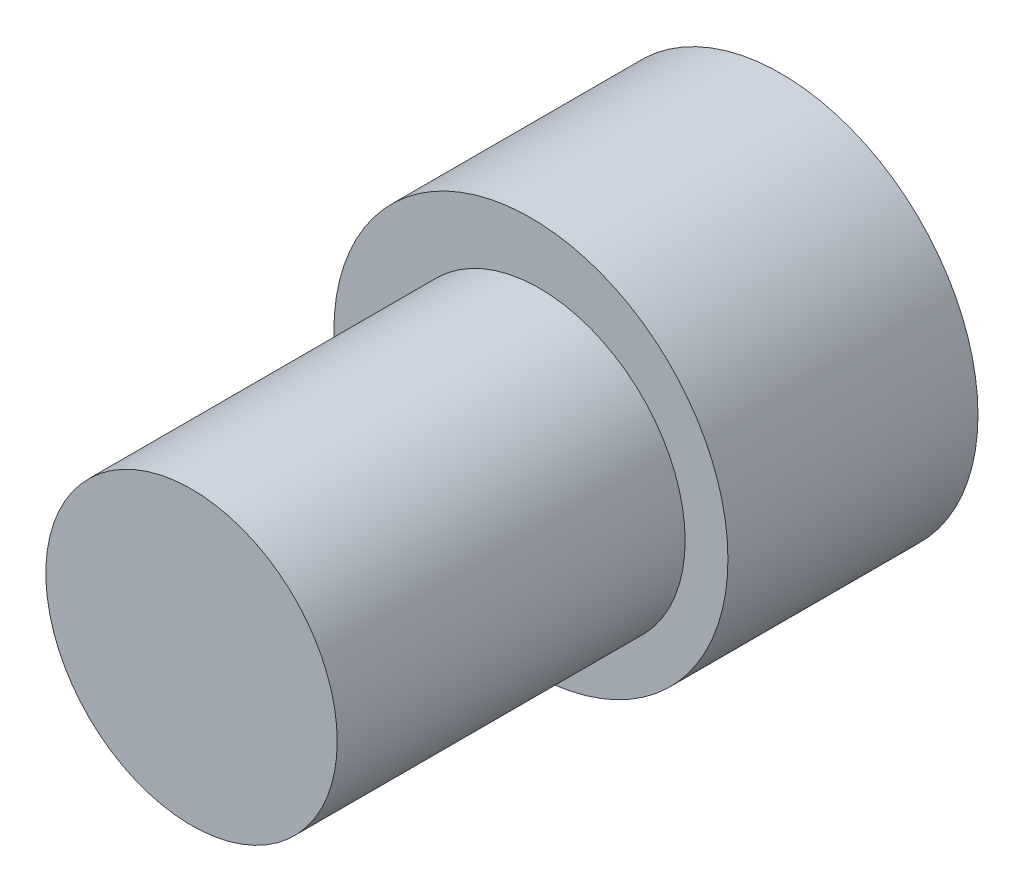
ISO-10303-21;
HEADER;
FILE_DESCRIPTION(('STEP AP214'),'2;1');
FILE_NAME('part.step','',(''),(''),'','','');
FILE_SCHEMA(('AUTOMOTIVE_DESIGN { 1 0 10303 214 1 1 1 1 }'));
ENDSEC;
DATA;
#1=APPLICATION_CONTEXT('core data for automotive mechanical design processes');
#2=APPLICATION_PROTOCOL_DEFINITION('international standard','automotive_design',2000,#1);
#3=PRODUCT_CONTEXT('',#1,'mechanical');
#4=PRODUCT('Part','Part','',(#3));
#5=PRODUCT_RELATED_PRODUCT_CATEGORY('part','',(#4));
#6=PRODUCT_DEFINITION_FORMATION('','',#4);
#7=PRODUCT_DEFINITION_CONTEXT('part definition',#1,'design');
#8=PRODUCT_DEFINITION('design','',#6,#7);
#9=PRODUCT_DEFINITION_SHAPE('','',#8);
#10=(LENGTH_UNIT() NAMED_UNIT(*) SI_UNIT(.MILLI.,.METRE.));
#11=(NAMED_UNIT(*) PLANE_ANGLE_UNIT() SI_UNIT($,.RADIAN.));
#12=(NAMED_UNIT(*) SI_UNIT($,.STERADIAN.) SOLID_ANGLE_UNIT());
#13=UNCERTAINTY_MEASURE_WITH_UNIT(LENGTH_MEASURE(1.E-05),#10,'distance_accuracy_value','');
#14=(GEOMETRIC_REPRESENTATION_CONTEXT(3) GLOBAL_UNCERTAINTY_ASSIGNED_CONTEXT((#13)) GLOBAL_UNIT_ASSIGNED_CONTEXT((#10,
#11,#12)) REPRESENTATION_CONTEXT('',''));
#15=CARTESIAN_POINT('',(0.,0.,0.));
#16=DIRECTION('',(0.,0.,1.));
#17=DIRECTION('',(1.,0.,0.));
#18=AXIS2_PLACEMENT_3D('',#15,#16,#17);
#19=CARTESIAN_POINT('',(-23.4305547451006,35.5720874073634,-27.2413561072351));
#20=DIRECTION('',(0.,0.,1.));
#21=DIRECTION('',(1.,0.,0.));
#22=AXIS2_PLACEMENT_3D('',#19,#20,#21);
#23=CYLINDRICAL_SURFACE('',#22,3.35000000000001);
#24=CARTESIAN_POINT('',(-23.4305547451006,35.5720874073634,-27.2413561072351));
#25=DIRECTION('',(0.,0.,1.));
#26=DIRECTION('',(1.,0.,0.));
#27=AXIS2_PLACEMENT_3D('',#24,#25,#26);
#28=CIRCLE('',#27,3.35000000000001);
#29=CARTESIAN_POINT('',(-20.0805547451006,35.5720874073634,-27.2413561072351));
#30=VERTEX_POINT('',#29);
#31=EDGE_CURVE('E43',#30,#30,#28,.T.);
#32=ORIENTED_EDGE('',*,*,#31,.T.);
#33=EDGE_LOOP('',(#32));
#34=FACE_BOUND('',#33,.T.);
#35=CARTESIAN_POINT('',(-23.4305547451006,35.5720874073634,-19.2413561072351));
#36=DIRECTION('',(0.,0.,1.));
#37=DIRECTION('',(1.,0.,0.));
#38=AXIS2_PLACEMENT_3D('',#35,#36,#37);
#39=CIRCLE('',#38,3.35000000000001);
#40=CARTESIAN_POINT('',(-20.0805547451006,35.5720874073634,-19.2413561072351));
#41=VERTEX_POINT('',#40);
#42=EDGE_CURVE('E10',#41,#41,#39,.T.);
#43=ORIENTED_EDGE('',*,*,#42,.F.);
#44=EDGE_LOOP('',(#43));
#45=FACE_BOUND('',#44,.T.);
#46=ADVANCED_FACE('F37',(#34,#45),#23,.T.);
#47=CARTESIAN_POINT('',(-23.4305547451006,35.5720874073634,-19.2413561072351));
#48=DIRECTION('',(0.,0.,1.));
#49=DIRECTION('',(1.,0.,0.));
#50=AXIS2_PLACEMENT_3D('',#47,#48,#49);
#51=PLANE('',#50);
#52=ORIENTED_EDGE('',*,*,#42,.T.);
#53=EDGE_LOOP('',(#52));
#54=FACE_BOUND('',#53,.T.);
#55=ADVANCED_FACE('F71',(#54),#51,.T.);
#56=CARTESIAN_POINT('',(-23.6277706749371,35.6933349857509,-32.9913561072351));
#57=DIRECTION('',(0.,0.,1.));
#58=DIRECTION('',(1.,0.,0.));
#59=AXIS2_PLACEMENT_3D('',#56,#57,#58);
#60=CYLINDRICAL_SURFACE('',#59,4.53119251932287);
#61=CARTESIAN_POINT('',(-23.6277706749371,35.6933349857509,-32.9913561072351));
#62=DIRECTION('',(0.,0.,-1.));
#63=DIRECTION('',(-1.,0.,0.));
#64=AXIS2_PLACEMENT_3D('',#61,#62,#63);
#65=CIRCLE('',#64,4.53119251932287);
#66=CARTESIAN_POINT('',(-28.15896319426,35.6933349857509,-32.9913561072351));
#67=VERTEX_POINT('',#66);
#68=EDGE_CURVE('E47',#67,#67,#65,.T.);
#69=ORIENTED_EDGE('',*,*,#68,.F.);
#70=EDGE_LOOP('',(#69));
#71=FACE_BOUND('',#70,.T.);
#72=CARTESIAN_POINT('',(-23.6277706749371,35.6933349857509,-27.2413561072351));
#73=DIRECTION('',(0.,0.,-1.));
#74=DIRECTION('',(-1.,0.,0.));
#75=AXIS2_PLACEMENT_3D('',#72,#73,#74);
#76=CIRCLE('',#75,4.53119251932287);
#77=CARTESIAN_POINT('',(-28.15896319426,35.6933349857509,-27.2413561072351));
#78=VERTEX_POINT('',#77);
#79=EDGE_CURVE('E51',#78,#78,#76,.T.);
#80=ORIENTED_EDGE('',*,*,#79,.T.);
#81=EDGE_LOOP('',(#80));
#82=FACE_BOUND('',#81,.T.);
#83=ADVANCED_FACE('F57',(#71,#82),#60,.T.);
#84=CARTESIAN_POINT('',(-23.6277706749371,35.6933349857509,-32.9913561072351));
#85=DIRECTION('',(0.,0.,-1.));
#86=DIRECTION('',(-1.,0.,0.));
#87=AXIS2_PLACEMENT_3D('',#84,#85,#86);
#88=PLANE('',#87);
#89=ORIENTED_EDGE('',*,*,#68,.T.);
#90=EDGE_LOOP('',(#89));
#91=FACE_BOUND('',#90,.T.);
#92=ADVANCED_FACE('F61',(#91),#88,.T.);
#93=CARTESIAN_POINT('',(-23.6277706749371,35.6933349857509,-27.2413561072351));
#94=DIRECTION('',(0.,0.,-1.));
#95=DIRECTION('',(-1.,0.,0.));
#96=AXIS2_PLACEMENT_3D('',#93,#94,#95);
#97=PLANE('',#96);
#98=ORIENTED_EDGE('',*,*,#31,.F.);
#99=EDGE_LOOP('',(#98));
#100=FACE_BOUND('',#99,.T.);
#101=ORIENTED_EDGE('',*,*,#79,.F.);
#102=EDGE_LOOP('',(#101));
#103=FACE_BOUND('',#102,.T.);
#104=ADVANCED_FACE('F59',(#100,#103),#97,.F.);
#105=CLOSED_SHELL('',(#46,#55,#83,#92,#104));
#106=MANIFOLD_SOLID_BREP('B2',#105);
#107=ADVANCED_BREP_SHAPE_REPRESENTATION('',(#18,#106),#14);
#108=SHAPE_DEFINITION_REPRESENTATION(#9,#107);
ENDSEC;
END-ISO-10303-21;
